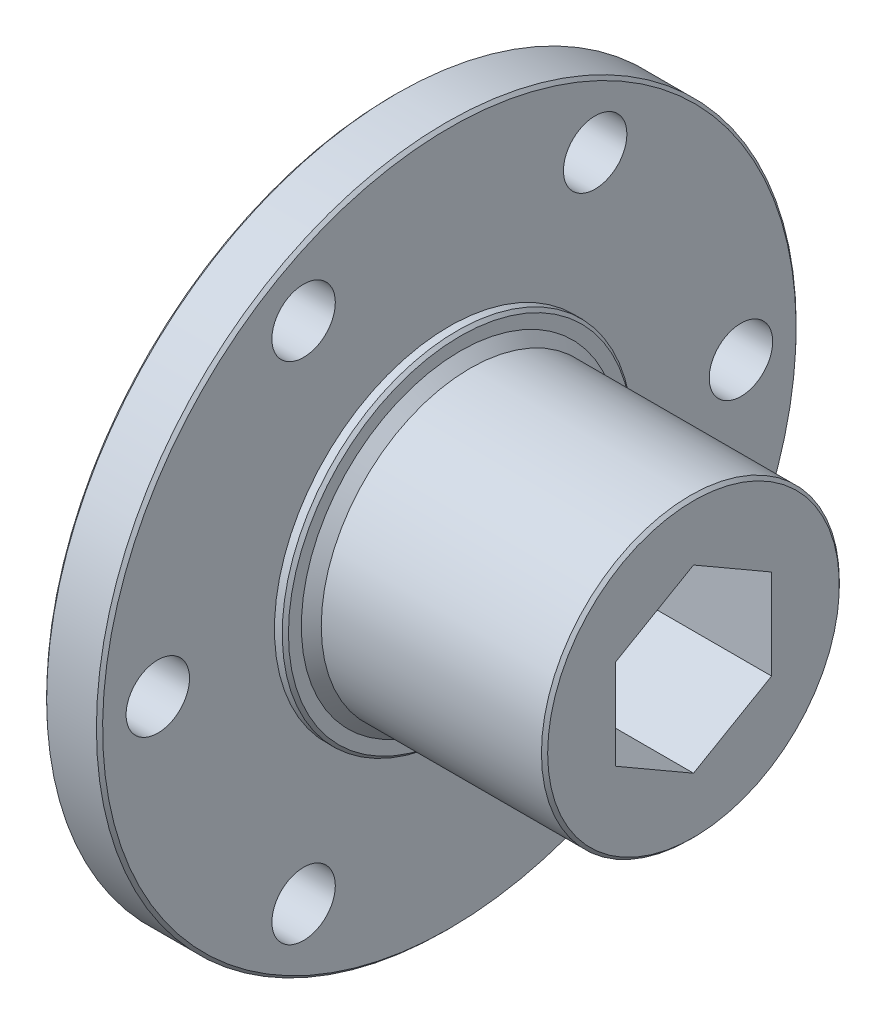
ISO-10303-21;
HEADER;
FILE_DESCRIPTION(('STEP AP214'),'2;1');
FILE_NAME('part.step','',(''),(''),'','','');
FILE_SCHEMA(('AUTOMOTIVE_DESIGN { 1 0 10303 214 1 1 1 1 }'));
ENDSEC;
DATA;
#1=APPLICATION_CONTEXT('core data for automotive mechanical design processes');
#2=APPLICATION_PROTOCOL_DEFINITION('international standard','automotive_design',2000,#1);
#3=PRODUCT_CONTEXT('',#1,'mechanical');
#4=PRODUCT('Part','Part','',(#3));
#5=PRODUCT_RELATED_PRODUCT_CATEGORY('part','',(#4));
#6=PRODUCT_DEFINITION_FORMATION('','',#4);
#7=PRODUCT_DEFINITION_CONTEXT('part definition',#1,'design');
#8=PRODUCT_DEFINITION('design','',#6,#7);
#9=PRODUCT_DEFINITION_SHAPE('','',#8);
#10=(LENGTH_UNIT() NAMED_UNIT(*) SI_UNIT(.MILLI.,.METRE.));
#11=(NAMED_UNIT(*) PLANE_ANGLE_UNIT() SI_UNIT($,.RADIAN.));
#12=(NAMED_UNIT(*) SI_UNIT($,.STERADIAN.) SOLID_ANGLE_UNIT());
#13=UNCERTAINTY_MEASURE_WITH_UNIT(LENGTH_MEASURE(1.E-05),#10,'distance_accuracy_value','');
#14=(GEOMETRIC_REPRESENTATION_CONTEXT(3) GLOBAL_UNCERTAINTY_ASSIGNED_CONTEXT((#13)) GLOBAL_UNIT_ASSIGNED_CONTEXT((#10,
#11,#12)) REPRESENTATION_CONTEXT('',''));
#15=CARTESIAN_POINT('',(0.,0.,0.));
#16=DIRECTION('',(0.,0.,1.));
#17=DIRECTION('',(1.,0.,0.));
#18=AXIS2_PLACEMENT_3D('',#15,#16,#17);
#19=CARTESIAN_POINT('',(6.01493375394323,0.,0.));
#20=DIRECTION('',(-1.,0.,0.));
#21=DIRECTION('',(0.,0.,1.));
#22=AXIS2_PLACEMENT_3D('',#19,#20,#21);
#23=CYLINDRICAL_SURFACE('',#22,12.1666);
#24=CARTESIAN_POINT('',(5.76093375394327,0.,0.));
#25=DIRECTION('',(-1.,0.,0.));
#26=DIRECTION('',(0.,0.,1.));
#27=AXIS2_PLACEMENT_3D('',#24,#25,#26);
#28=CIRCLE('',#27,12.1666);
#29=CARTESIAN_POINT('',(5.76093375394327,0.,12.1666));
#30=VERTEX_POINT('',#29);
#31=EDGE_CURVE('E99',#30,#30,#28,.F.);
#32=ORIENTED_EDGE('',*,*,#31,.F.);
#33=EDGE_LOOP('',(#32));
#34=FACE_BOUND('',#33,.T.);
#35=CARTESIAN_POINT('',(-12.2222662460567,0.,0.));
#36=DIRECTION('',(-1.,0.,0.));
#37=DIRECTION('',(0.,0.,1.));
#38=AXIS2_PLACEMENT_3D('',#35,#36,#37);
#39=CIRCLE('',#38,12.1666);
#40=CARTESIAN_POINT('',(-12.2222662460567,0.,12.1666));
#41=VERTEX_POINT('',#40);
#42=EDGE_CURVE('E96',#41,#41,#39,.T.);
#43=ORIENTED_EDGE('',*,*,#42,.F.);
#44=EDGE_LOOP('',(#43));
#45=FACE_BOUND('',#44,.T.);
#46=ADVANCED_FACE('F15',(#34,#45),#23,.T.);
#47=CARTESIAN_POINT('',(5.76093375394327,0.,0.));
#48=DIRECTION('',(-1.,0.,0.));
#49=DIRECTION('',(0.,0.,1.));
#50=AXIS2_PLACEMENT_3D('',#47,#48,#49);
#51=CONICAL_SURFACE('',#50,12.1666,0.785398163397465);
#52=ORIENTED_EDGE('',*,*,#31,.T.);
#53=EDGE_LOOP('',(#52));
#54=FACE_BOUND('',#53,.T.);
#55=CARTESIAN_POINT('',(6.01493375394323,0.,0.));
#56=DIRECTION('',(-1.,0.,0.));
#57=DIRECTION('',(0.,0.,1.));
#58=AXIS2_PLACEMENT_3D('',#55,#56,#57);
#59=CIRCLE('',#58,11.9126);
#60=CARTESIAN_POINT('',(6.01493375394323,0.,11.9126));
#61=VERTEX_POINT('',#60);
#62=EDGE_CURVE('E18',#61,#61,#59,.F.);
#63=ORIENTED_EDGE('',*,*,#62,.F.);
#64=EDGE_LOOP('',(#63));
#65=FACE_BOUND('',#64,.T.);
#66=ADVANCED_FACE('F162',(#54,#65),#51,.T.);
#67=CARTESIAN_POINT('',(-13.0350662460568,0.,0.));
#68=DIRECTION('',(-1.,0.,0.));
#69=DIRECTION('',(0.,-1.,0.));
#70=AXIS2_PLACEMENT_3D('',#67,#68,#69);
#71=CONICAL_SURFACE('',#70,12.9794,0.785398163397438);
#72=ORIENTED_EDGE('',*,*,#42,.T.);
#73=EDGE_LOOP('',(#72));
#74=FACE_BOUND('',#73,.T.);
#75=CARTESIAN_POINT('',(-13.0350662460568,0.,0.));
#76=DIRECTION('',(-1.,0.,0.));
#77=DIRECTION('',(0.,-1.,0.));
#78=AXIS2_PLACEMENT_3D('',#75,#76,#77);
#79=CIRCLE('',#78,12.9794);
#80=CARTESIAN_POINT('',(-13.0350662460568,-12.9794,0.));
#81=VERTEX_POINT('',#80);
#82=EDGE_CURVE('E81',#81,#81,#79,.T.);
#83=ORIENTED_EDGE('',*,*,#82,.F.);
#84=EDGE_LOOP('',(#83));
#85=FACE_BOUND('',#84,.T.);
#86=ADVANCED_FACE('F164',(#74,#85),#71,.T.);
#87=CARTESIAN_POINT('',(6.01493375394323,0.,0.));
#88=DIRECTION('',(1.,0.,0.));
#89=DIRECTION('',(0.,0.,-1.));
#90=AXIS2_PLACEMENT_3D('',#87,#88,#89);
#91=PLANE('',#90);
#92=DIRECTION('',(0.,1.,0.));
#93=VECTOR('',#92,1.);
#94=CARTESIAN_POINT('',(6.01493375394323,-3.68085890619153,-6.37539999999999));
#95=LINE('',#94,#93);
#96=CARTESIAN_POINT('',(6.01493375394323,3.68081890619155,-6.37539999999999));
#97=VERTEX_POINT('',#96);
#98=CARTESIAN_POINT('',(6.01493375394323,-3.68085890619153,-6.37539999999999));
#99=VERTEX_POINT('',#98);
#100=EDGE_CURVE('E90',#97,#99,#95,.F.);
#101=ORIENTED_EDGE('',*,*,#100,.T.);
#102=DIRECTION('',(0.,0.500000000000001,-0.866025403784438));
#103=VECTOR('',#102,1.);
#104=CARTESIAN_POINT('',(6.01493375394323,-7.36169781238308,0.));
#105=LINE('',#104,#103);
#106=CARTESIAN_POINT('',(6.01493375394323,-7.36169781238308,0.));
#107=VERTEX_POINT('',#106);
#108=EDGE_CURVE('E66',#99,#107,#105,.F.);
#109=ORIENTED_EDGE('',*,*,#108,.T.);
#110=DIRECTION('',(0.,-0.500000000000001,-0.866025403784438));
#111=VECTOR('',#110,1.);
#112=CARTESIAN_POINT('',(6.01493375394323,-3.68085890619153,6.3754));
#113=LINE('',#112,#111);
#114=CARTESIAN_POINT('',(6.01493375394323,-3.68085890619153,6.3754));
#115=VERTEX_POINT('',#114);
#116=EDGE_CURVE('E72',#107,#115,#113,.F.);
#117=ORIENTED_EDGE('',*,*,#116,.T.);
#118=DIRECTION('',(0.,-1.,0.));
#119=VECTOR('',#118,1.);
#120=CARTESIAN_POINT('',(6.01493375394323,3.68081890619155,6.3754));
#121=LINE('',#120,#119);
#122=CARTESIAN_POINT('',(6.01493375394323,3.68081890619155,6.3754));
#123=VERTEX_POINT('',#122);
#124=EDGE_CURVE('E155',#115,#123,#121,.F.);
#125=ORIENTED_EDGE('',*,*,#124,.T.);
#126=DIRECTION('',(0.,-0.500000000000001,0.866025403784438));
#127=VECTOR('',#126,1.);
#128=CARTESIAN_POINT('',(6.01493375394323,7.3616578123831,0.));
#129=LINE('',#128,#127);
#130=CARTESIAN_POINT('',(6.01493375394323,7.3616578123831,0.));
#131=VERTEX_POINT('',#130);
#132=EDGE_CURVE('E480',#123,#131,#129,.F.);
#133=ORIENTED_EDGE('',*,*,#132,.T.);
#134=DIRECTION('',(0.,0.500000000000001,0.866025403784438));
#135=VECTOR('',#134,1.);
#136=CARTESIAN_POINT('',(6.01493375394323,3.68081890619155,-6.37539999999999));
#137=LINE('',#136,#135);
#138=EDGE_CURVE('E486',#131,#97,#137,.F.);
#139=ORIENTED_EDGE('',*,*,#138,.T.);
#140=EDGE_LOOP('',(#101,#109,#117,#125,#133,#139));
#141=FACE_BOUND('',#140,.T.);
#142=ORIENTED_EDGE('',*,*,#62,.T.);
#143=EDGE_LOOP('',(#142));
#144=FACE_BOUND('',#143,.T.);
#145=ADVANCED_FACE('F87',(#141,#144),#91,.T.);
#146=CARTESIAN_POINT('',(-13.0350662460568,28.575,0.));
#147=DIRECTION('',(1.,0.,0.));
#148=DIRECTION('',(0.,0.,-1.));
#149=AXIS2_PLACEMENT_3D('',#146,#147,#148);
#150=PLANE('',#149);
#151=ORIENTED_EDGE('',*,*,#82,.T.);
#152=EDGE_LOOP('',(#151));
#153=FACE_BOUND('',#152,.T.);
#154=CARTESIAN_POINT('',(-13.0350662460568,0.,0.));
#155=DIRECTION('',(-1.,0.,0.));
#156=DIRECTION('',(0.,-1.,0.));
#157=AXIS2_PLACEMENT_3D('',#154,#155,#156);
#158=CIRCLE('',#157,14.0335);
#159=CARTESIAN_POINT('',(-13.0350662460568,-14.0335,0.));
#160=VERTEX_POINT('',#159);
#161=EDGE_CURVE('E152',#160,#160,#158,.T.);
#162=ORIENTED_EDGE('',*,*,#161,.F.);
#163=EDGE_LOOP('',(#162));
#164=FACE_BOUND('',#163,.T.);
#165=ADVANCED_FACE('F262',(#153,#164),#150,.T.);
#166=CARTESIAN_POINT('',(-19.3850662460568,-3.68085890619153,6.3754));
#167=DIRECTION('',(0.,-0.866025403784438,0.500000000000001));
#168=DIRECTION('',(0.,-0.500000000000001,-0.866025403784438));
#169=AXIS2_PLACEMENT_3D('',#166,#167,#168);
#170=PLANE('',#169);
#171=DIRECTION('',(1.,0.,0.));
#172=VECTOR('',#171,1.);
#173=CARTESIAN_POINT('',(-19.3850662460568,-7.36169781238308,0.));
#174=LINE('',#173,#172);
#175=CARTESIAN_POINT('',(-19.3850662460568,-7.36169781238308,0.));
#176=VERTEX_POINT('',#175);
#177=EDGE_CURVE('E75',#107,#176,#174,.F.);
#178=ORIENTED_EDGE('',*,*,#177,.T.);
#179=DIRECTION('',(0.,-0.500000000000001,-0.866025403784438));
#180=VECTOR('',#179,1.);
#181=CARTESIAN_POINT('',(-19.3850662460568,-3.68085890619153,6.3754));
#182=LINE('',#181,#180);
#183=CARTESIAN_POINT('',(-19.3850662460568,-3.68085890619153,6.3754));
#184=VERTEX_POINT('',#183);
#185=EDGE_CURVE('E154',#184,#176,#182,.T.);
#186=ORIENTED_EDGE('',*,*,#185,.F.);
#187=DIRECTION('',(1.,0.,0.));
#188=VECTOR('',#187,1.);
#189=CARTESIAN_POINT('',(-19.3850662460568,-3.68085890619153,6.3754));
#190=LINE('',#189,#188);
#191=EDGE_CURVE('E77',#184,#115,#190,.T.);
#192=ORIENTED_EDGE('',*,*,#191,.T.);
#193=ORIENTED_EDGE('',*,*,#116,.F.);
#194=EDGE_LOOP('',(#178,#186,#192,#193));
#195=FACE_BOUND('',#194,.T.);
#196=ADVANCED_FACE('F73',(#195),#170,.F.);
#197=CARTESIAN_POINT('',(-19.3850662460568,-7.36169781238308,0.));
#198=DIRECTION('',(0.,-0.866025403784438,-0.500000000000001));
#199=DIRECTION('',(0.,0.500000000000001,-0.866025403784438));
#200=AXIS2_PLACEMENT_3D('',#197,#198,#199);
#201=PLANE('',#200);
#202=DIRECTION('',(1.,0.,0.));
#203=VECTOR('',#202,1.);
#204=CARTESIAN_POINT('',(-19.3850662460568,-3.68085890619153,-6.37539999999999));
#205=LINE('',#204,#203);
#206=CARTESIAN_POINT('',(-19.3850662460568,-3.68085890619153,-6.37539999999999));
#207=VERTEX_POINT('',#206);
#208=EDGE_CURVE('E91',#99,#207,#205,.F.);
#209=ORIENTED_EDGE('',*,*,#208,.T.);
#210=DIRECTION('',(0.,0.500000000000001,-0.866025403784438));
#211=VECTOR('',#210,1.);
#212=CARTESIAN_POINT('',(-19.3850662460568,-7.36169781238308,0.));
#213=LINE('',#212,#211);
#214=EDGE_CURVE('E84',#176,#207,#213,.T.);
#215=ORIENTED_EDGE('',*,*,#214,.F.);
#216=ORIENTED_EDGE('',*,*,#177,.F.);
#217=ORIENTED_EDGE('',*,*,#108,.F.);
#218=EDGE_LOOP('',(#209,#215,#216,#217));
#219=FACE_BOUND('',#218,.T.);
#220=ADVANCED_FACE('F83',(#219),#201,.F.);
#221=CARTESIAN_POINT('',(-19.3850662460568,-3.68085890619153,-6.37539999999999));
#222=DIRECTION('',(0.,0.,-1.));
#223=DIRECTION('',(0.,1.,0.));
#224=AXIS2_PLACEMENT_3D('',#221,#222,#223);
#225=PLANE('',#224);
#226=DIRECTION('',(1.,0.,0.));
#227=VECTOR('',#226,1.);
#228=CARTESIAN_POINT('',(-19.3850662460568,3.68081890619155,-6.37539999999999));
#229=LINE('',#228,#227);
#230=CARTESIAN_POINT('',(-19.3850662460568,3.68081890619155,-6.37539999999999));
#231=VERTEX_POINT('',#230);
#232=EDGE_CURVE('E488',#97,#231,#229,.F.);
#233=ORIENTED_EDGE('',*,*,#232,.T.);
#234=DIRECTION('',(0.,1.,0.));
#235=VECTOR('',#234,1.);
#236=CARTESIAN_POINT('',(-19.3850662460568,0.,-6.37539999999999));
#237=LINE('',#236,#235);
#238=EDGE_CURVE('E493',#207,#231,#237,.T.);
#239=ORIENTED_EDGE('',*,*,#238,.F.);
#240=ORIENTED_EDGE('',*,*,#208,.F.);
#241=ORIENTED_EDGE('',*,*,#100,.F.);
#242=EDGE_LOOP('',(#233,#239,#240,#241));
#243=FACE_BOUND('',#242,.T.);
#244=ADVANCED_FACE('F253',(#243),#225,.F.);
#245=CARTESIAN_POINT('',(-19.3850662460568,3.68081890619155,-6.37539999999999));
#246=DIRECTION('',(0.,0.866025403784438,-0.500000000000001));
#247=DIRECTION('',(0.,0.500000000000001,0.866025403784438));
#248=AXIS2_PLACEMENT_3D('',#245,#246,#247);
#249=PLANE('',#248);
#250=DIRECTION('',(1.,0.,0.));
#251=VECTOR('',#250,1.);
#252=CARTESIAN_POINT('',(-19.3850662460568,7.3616578123831,0.));
#253=LINE('',#252,#251);
#254=CARTESIAN_POINT('',(-19.3850662460568,7.3616578123831,0.));
#255=VERTEX_POINT('',#254);
#256=EDGE_CURVE('E483',#131,#255,#253,.F.);
#257=ORIENTED_EDGE('',*,*,#256,.T.);
#258=DIRECTION('',(0.,0.500000000000001,0.866025403784438));
#259=VECTOR('',#258,1.);
#260=CARTESIAN_POINT('',(-19.3850662460568,3.68081890619155,-6.37539999999999));
#261=LINE('',#260,#259);
#262=EDGE_CURVE('E494',#231,#255,#261,.T.);
#263=ORIENTED_EDGE('',*,*,#262,.F.);
#264=ORIENTED_EDGE('',*,*,#232,.F.);
#265=ORIENTED_EDGE('',*,*,#138,.F.);
#266=EDGE_LOOP('',(#257,#263,#264,#265));
#267=FACE_BOUND('',#266,.T.);
#268=ADVANCED_FACE('F249',(#267),#249,.F.);
#269=CARTESIAN_POINT('',(-19.3850662460568,7.3616578123831,0.));
#270=DIRECTION('',(0.,0.866025403784438,0.500000000000001));
#271=DIRECTION('',(0.,-0.500000000000001,0.866025403784438));
#272=AXIS2_PLACEMENT_3D('',#269,#270,#271);
#273=PLANE('',#272);
#274=DIRECTION('',(1.,0.,0.));
#275=VECTOR('',#274,1.);
#276=CARTESIAN_POINT('',(-19.3850662460568,3.68081890619155,6.3754));
#277=LINE('',#276,#275);
#278=CARTESIAN_POINT('',(-19.3850662460568,3.68081890619155,6.3754));
#279=VERTEX_POINT('',#278);
#280=EDGE_CURVE('E478',#123,#279,#277,.F.);
#281=ORIENTED_EDGE('',*,*,#280,.T.);
#282=DIRECTION('',(0.,-0.500000000000001,0.866025403784438));
#283=VECTOR('',#282,1.);
#284=CARTESIAN_POINT('',(-19.3850662460568,7.3616578123831,0.));
#285=LINE('',#284,#283);
#286=EDGE_CURVE('E33',#255,#279,#285,.T.);
#287=ORIENTED_EDGE('',*,*,#286,.F.);
#288=ORIENTED_EDGE('',*,*,#256,.F.);
#289=ORIENTED_EDGE('',*,*,#132,.F.);
#290=EDGE_LOOP('',(#281,#287,#288,#289));
#291=FACE_BOUND('',#290,.T.);
#292=ADVANCED_FACE('F245',(#291),#273,.F.);
#293=CARTESIAN_POINT('',(-19.3850662460568,3.68081890619155,6.3754));
#294=DIRECTION('',(0.,0.,1.));
#295=DIRECTION('',(0.,-1.,0.));
#296=AXIS2_PLACEMENT_3D('',#293,#294,#295);
#297=PLANE('',#296);
#298=ORIENTED_EDGE('',*,*,#191,.F.);
#299=DIRECTION('',(0.,1.,0.));
#300=VECTOR('',#299,1.);
#301=CARTESIAN_POINT('',(-19.3850662460568,0.,6.3754));
#302=LINE('',#301,#300);
#303=EDGE_CURVE('E469',#279,#184,#302,.F.);
#304=ORIENTED_EDGE('',*,*,#303,.F.);
#305=ORIENTED_EDGE('',*,*,#280,.F.);
#306=ORIENTED_EDGE('',*,*,#124,.F.);
#307=EDGE_LOOP('',(#298,#304,#305,#306));
#308=FACE_BOUND('',#307,.T.);
#309=ADVANCED_FACE('F241',(#308),#297,.F.);
#310=CARTESIAN_POINT('',(-13.2890662460568,0.,0.));
#311=DIRECTION('',(-1.,0.,0.));
#312=DIRECTION('',(0.,-1.,0.));
#313=AXIS2_PLACEMENT_3D('',#310,#311,#312);
#314=CONICAL_SURFACE('',#313,14.2875,0.785398163397452);
#315=ORIENTED_EDGE('',*,*,#161,.T.);
#316=EDGE_LOOP('',(#315));
#317=FACE_BOUND('',#316,.T.);
#318=CARTESIAN_POINT('',(-13.2890662460568,0.,0.));
#319=DIRECTION('',(1.,0.,0.));
#320=DIRECTION('',(0.,0.,-1.));
#321=AXIS2_PLACEMENT_3D('',#318,#319,#320);
#322=CIRCLE('',#321,14.2875);
#323=CARTESIAN_POINT('',(-13.2890662460568,0.,-14.2875));
#324=VERTEX_POINT('',#323);
#325=EDGE_CURVE('E467',#324,#324,#322,.F.);
#326=ORIENTED_EDGE('',*,*,#325,.F.);
#327=EDGE_LOOP('',(#326));
#328=FACE_BOUND('',#327,.T.);
#329=ADVANCED_FACE('F238',(#317,#328),#314,.T.);
#330=CARTESIAN_POINT('',(-19.3850662460568,0.,0.));
#331=DIRECTION('',(-1.,0.,0.));
#332=DIRECTION('',(0.,0.,1.));
#333=AXIS2_PLACEMENT_3D('',#330,#331,#332);
#334=PLANE('',#333);
#335=ORIENTED_EDGE('',*,*,#286,.T.);
#336=ORIENTED_EDGE('',*,*,#303,.T.);
#337=ORIENTED_EDGE('',*,*,#185,.T.);
#338=ORIENTED_EDGE('',*,*,#214,.T.);
#339=ORIENTED_EDGE('',*,*,#238,.T.);
#340=ORIENTED_EDGE('',*,*,#262,.T.);
#341=EDGE_LOOP('',(#335,#336,#337,#338,#339,#340));
#342=FACE_BOUND('',#341,.T.);
#343=CARTESIAN_POINT('',(-19.3850662460568,0.,0.));
#344=DIRECTION('',(1.,0.,0.));
#345=DIRECTION('',(0.,0.,-1.));
#346=AXIS2_PLACEMENT_3D('',#343,#344,#345);
#347=CIRCLE('',#346,14.0335);
#348=CARTESIAN_POINT('',(-19.3850662460568,0.,-14.0335));
#349=VERTEX_POINT('',#348);
#350=EDGE_CURVE('E148',#349,#349,#347,.T.);
#351=ORIENTED_EDGE('',*,*,#350,.F.);
#352=EDGE_LOOP('',(#351));
#353=FACE_BOUND('',#352,.T.);
#354=ADVANCED_FACE('F234',(#342,#353),#334,.T.);
#355=CARTESIAN_POINT('',(-14.1780662460568,0.,0.));
#356=DIRECTION('',(-1.,0.,0.));
#357=DIRECTION('',(0.,-1.,0.));
#358=AXIS2_PLACEMENT_3D('',#355,#356,#357);
#359=CONICAL_SURFACE('',#358,28.575,0.785398163397445);
#360=CARTESIAN_POINT('',(-14.1780662460568,0.,0.));
#361=DIRECTION('',(-1.,0.,0.));
#362=DIRECTION('',(0.,0.,1.));
#363=AXIS2_PLACEMENT_3D('',#360,#361,#362);
#364=CIRCLE('',#363,28.575);
#365=CARTESIAN_POINT('',(-14.1780662460568,0.,28.575));
#366=VERTEX_POINT('',#365);
#367=EDGE_CURVE('E151',#366,#366,#364,.T.);
#368=ORIENTED_EDGE('',*,*,#367,.F.);
#369=EDGE_LOOP('',(#368));
#370=FACE_BOUND('',#369,.T.);
#371=CARTESIAN_POINT('',(-13.9240662460568,0.,0.));
#372=DIRECTION('',(-1.,0.,0.));
#373=DIRECTION('',(0.,-1.,0.));
#374=AXIS2_PLACEMENT_3D('',#371,#372,#373);
#375=CIRCLE('',#374,28.321);
#376=CARTESIAN_POINT('',(-13.9240662460568,-28.321,0.));
#377=VERTEX_POINT('',#376);
#378=EDGE_CURVE('E145',#377,#377,#375,.F.);
#379=ORIENTED_EDGE('',*,*,#378,.F.);
#380=EDGE_LOOP('',(#379));
#381=FACE_BOUND('',#380,.T.);
#382=ADVANCED_FACE('F230',(#370,#381),#359,.T.);
#383=CARTESIAN_POINT('',(14.3030238953624,0.,0.));
#384=DIRECTION('',(1.,0.,0.));
#385=DIRECTION('',(0.,0.,-1.));
#386=AXIS2_PLACEMENT_3D('',#383,#384,#385);
#387=CYLINDRICAL_SURFACE('',#386,14.2875);
#388=CARTESIAN_POINT('',(-13.9240662460568,0.,0.));
#389=DIRECTION('',(1.,0.,0.));
#390=DIRECTION('',(0.,0.,-1.));
#391=AXIS2_PLACEMENT_3D('',#388,#389,#390);
#392=CIRCLE('',#391,14.2875);
#393=CARTESIAN_POINT('',(-13.9240662460568,0.,-14.2875));
#394=VERTEX_POINT('',#393);
#395=EDGE_CURVE('E142',#394,#394,#392,.F.);
#396=ORIENTED_EDGE('',*,*,#395,.F.);
#397=EDGE_LOOP('',(#396));
#398=FACE_BOUND('',#397,.T.);
#399=ORIENTED_EDGE('',*,*,#325,.T.);
#400=EDGE_LOOP('',(#399));
#401=FACE_BOUND('',#400,.T.);
#402=ADVANCED_FACE('F226',(#398,#401),#387,.T.);
#403=CARTESIAN_POINT('',(-13.0350662460568,0.,0.));
#404=DIRECTION('',(-1.,0.,0.));
#405=DIRECTION('',(0.,0.,1.));
#406=AXIS2_PLACEMENT_3D('',#403,#404,#405);
#407=CYLINDRICAL_SURFACE('',#406,28.575);
#408=ORIENTED_EDGE('',*,*,#367,.T.);
#409=EDGE_LOOP('',(#408));
#410=FACE_BOUND('',#409,.T.);
#411=CARTESIAN_POINT('',(-18.2420662460568,0.,0.));
#412=DIRECTION('',(1.,0.,0.));
#413=DIRECTION('',(0.,0.,-1.));
#414=AXIS2_PLACEMENT_3D('',#411,#412,#413);
#415=CIRCLE('',#414,28.575);
#416=CARTESIAN_POINT('',(-18.2420662460568,0.,-28.575));
#417=VERTEX_POINT('',#416);
#418=EDGE_CURVE('E141',#417,#417,#415,.F.);
#419=ORIENTED_EDGE('',*,*,#418,.F.);
#420=EDGE_LOOP('',(#419));
#421=FACE_BOUND('',#420,.T.);
#422=ADVANCED_FACE('F222',(#410,#421),#407,.T.);
#423=CARTESIAN_POINT('',(-19.1310662460568,0.,0.));
#424=DIRECTION('',(1.,0.,0.));
#425=DIRECTION('',(0.,0.,-1.));
#426=AXIS2_PLACEMENT_3D('',#423,#424,#425);
#427=CONICAL_SURFACE('',#426,14.2875,0.785398163397452);
#428=CARTESIAN_POINT('',(-19.1310662460568,0.,0.));
#429=DIRECTION('',(1.,0.,0.));
#430=DIRECTION('',(0.,0.,-1.));
#431=AXIS2_PLACEMENT_3D('',#428,#429,#430);
#432=CIRCLE('',#431,14.2875);
#433=CARTESIAN_POINT('',(-19.1310662460568,0.,-14.2875));
#434=VERTEX_POINT('',#433);
#435=EDGE_CURVE('E131',#434,#434,#432,.T.);
#436=ORIENTED_EDGE('',*,*,#435,.F.);
#437=EDGE_LOOP('',(#436));
#438=FACE_BOUND('',#437,.T.);
#439=ORIENTED_EDGE('',*,*,#350,.T.);
#440=EDGE_LOOP('',(#439));
#441=FACE_BOUND('',#440,.T.);
#442=ADVANCED_FACE('F218',(#438,#441),#427,.T.);
#443=CARTESIAN_POINT('',(-13.9240662460568,0.,5.72637987752451));
#444=DIRECTION('',(1.,0.,0.));
#445=DIRECTION('',(0.,0.,-1.));
#446=AXIS2_PLACEMENT_3D('',#443,#444,#445);
#447=PLANE('',#446);
#448=CARTESIAN_POINT('',(-13.9240662460568,0.,23.8125));
#449=DIRECTION('',(1.,0.,0.));
#450=DIRECTION('',(0.,0.,-1.));
#451=AXIS2_PLACEMENT_3D('',#448,#449,#450);
#452=CIRCLE('',#451,2.59080000000001);
#453=CARTESIAN_POINT('',(-13.9240662460568,0.,21.2217));
#454=VERTEX_POINT('',#453);
#455=EDGE_CURVE('E122',#454,#454,#452,.F.);
#456=ORIENTED_EDGE('',*,*,#455,.T.);
#457=EDGE_LOOP('',(#456));
#458=FACE_BOUND('',#457,.T.);
#459=CARTESIAN_POINT('',(-13.9240662460568,20.622229927617,-11.90625));
#460=DIRECTION('',(1.,0.,0.));
#461=DIRECTION('',(0.,0.,-1.));
#462=AXIS2_PLACEMENT_3D('',#459,#460,#461);
#463=CIRCLE('',#462,2.59080000000001);
#464=CARTESIAN_POINT('',(-13.9240662460568,20.622229927617,-14.49705));
#465=VERTEX_POINT('',#464);
#466=EDGE_CURVE('E125',#465,#465,#463,.F.);
#467=ORIENTED_EDGE('',*,*,#466,.T.);
#468=EDGE_LOOP('',(#467));
#469=FACE_BOUND('',#468,.T.);
#470=CARTESIAN_POINT('',(-13.9240662460568,-20.6222299276169,-11.90625));
#471=DIRECTION('',(1.,0.,0.));
#472=DIRECTION('',(0.,0.,-1.));
#473=AXIS2_PLACEMENT_3D('',#470,#471,#472);
#474=CIRCLE('',#473,2.59080000000001);
#475=CARTESIAN_POINT('',(-13.9240662460568,-20.6222299276169,-14.4970500000001));
#476=VERTEX_POINT('',#475);
#477=EDGE_CURVE('E128',#476,#476,#474,.F.);
#478=ORIENTED_EDGE('',*,*,#477,.T.);
#479=EDGE_LOOP('',(#478));
#480=FACE_BOUND('',#479,.T.);
#481=ORIENTED_EDGE('',*,*,#395,.T.);
#482=EDGE_LOOP('',(#481));
#483=FACE_BOUND('',#482,.T.);
#484=CARTESIAN_POINT('',(-13.9240662460568,-20.622229927617,11.9062499999999));
#485=DIRECTION('',(1.,0.,0.));
#486=DIRECTION('',(0.,0.,-1.));
#487=AXIS2_PLACEMENT_3D('',#484,#485,#486);
#488=CIRCLE('',#487,2.59080000000001);
#489=CARTESIAN_POINT('',(-13.9240662460568,-20.622229927617,9.31544999999993));
#490=VERTEX_POINT('',#489);
#491=EDGE_CURVE('E132',#490,#490,#488,.F.);
#492=ORIENTED_EDGE('',*,*,#491,.T.);
#493=EDGE_LOOP('',(#492));
#494=FACE_BOUND('',#493,.T.);
#495=CARTESIAN_POINT('',(-13.9240662460568,0.,-23.8125));
#496=DIRECTION('',(1.,0.,0.));
#497=DIRECTION('',(0.,0.,-1.));
#498=AXIS2_PLACEMENT_3D('',#495,#496,#497);
#499=CIRCLE('',#498,2.59080000000001);
#500=CARTESIAN_POINT('',(-13.9240662460568,0.,-26.4033));
#501=VERTEX_POINT('',#500);
#502=EDGE_CURVE('E135',#501,#501,#499,.F.);
#503=ORIENTED_EDGE('',*,*,#502,.T.);
#504=EDGE_LOOP('',(#503));
#505=FACE_BOUND('',#504,.T.);
#506=CARTESIAN_POINT('',(-13.9240662460568,20.6222299276169,11.90625));
#507=DIRECTION('',(1.,0.,0.));
#508=DIRECTION('',(0.,0.,-1.));
#509=AXIS2_PLACEMENT_3D('',#506,#507,#508);
#510=CIRCLE('',#509,2.59080000000001);
#511=CARTESIAN_POINT('',(-13.9240662460568,20.6222299276169,9.31544999999999));
#512=VERTEX_POINT('',#511);
#513=EDGE_CURVE('E138',#512,#512,#510,.F.);
#514=ORIENTED_EDGE('',*,*,#513,.T.);
#515=EDGE_LOOP('',(#514));
#516=FACE_BOUND('',#515,.T.);
#517=ORIENTED_EDGE('',*,*,#378,.T.);
#518=EDGE_LOOP('',(#517));
#519=FACE_BOUND('',#518,.T.);
#520=ADVANCED_FACE('F214',(#458,#469,#480,#483,#494,#505,#516,#519),#447,.T.);
#521=CARTESIAN_POINT('',(-18.2420662460568,0.,0.));
#522=DIRECTION('',(1.,0.,0.));
#523=DIRECTION('',(0.,0.,-1.));
#524=AXIS2_PLACEMENT_3D('',#521,#522,#523);
#525=CONICAL_SURFACE('',#524,28.575,0.785398163397448);
#526=CARTESIAN_POINT('',(-18.4960662460568,0.,0.));
#527=DIRECTION('',(1.,0.,0.));
#528=DIRECTION('',(0.,0.,-1.));
#529=AXIS2_PLACEMENT_3D('',#526,#527,#528);
#530=CIRCLE('',#529,28.321);
#531=CARTESIAN_POINT('',(-18.4960662460568,0.,-28.321));
#532=VERTEX_POINT('',#531);
#533=EDGE_CURVE('E119',#532,#532,#530,.T.);
#534=ORIENTED_EDGE('',*,*,#533,.T.);
#535=EDGE_LOOP('',(#534));
#536=FACE_BOUND('',#535,.T.);
#537=ORIENTED_EDGE('',*,*,#418,.T.);
#538=EDGE_LOOP('',(#537));
#539=FACE_BOUND('',#538,.T.);
#540=ADVANCED_FACE('F210',(#536,#539),#525,.T.);
#541=CARTESIAN_POINT('',(-13.0350662460568,20.6222299276169,11.90625));
#542=DIRECTION('',(1.,0.,0.));
#543=DIRECTION('',(0.,0.,-1.));
#544=AXIS2_PLACEMENT_3D('',#541,#542,#543);
#545=CYLINDRICAL_SURFACE('',#544,2.59080000000001);
#546=ORIENTED_EDGE('',*,*,#513,.F.);
#547=EDGE_LOOP('',(#546));
#548=FACE_BOUND('',#547,.T.);
#549=CARTESIAN_POINT('',(-18.4960662460568,20.6222299276169,11.90625));
#550=DIRECTION('',(1.,0.,0.));
#551=DIRECTION('',(0.,0.,-1.));
#552=AXIS2_PLACEMENT_3D('',#549,#550,#551);
#553=CIRCLE('',#552,2.59080000000001);
#554=CARTESIAN_POINT('',(-18.4960662460568,20.6222299276169,9.31544999999999));
#555=VERTEX_POINT('',#554);
#556=EDGE_CURVE('E116',#555,#555,#553,.F.);
#557=ORIENTED_EDGE('',*,*,#556,.T.);
#558=EDGE_LOOP('',(#557));
#559=FACE_BOUND('',#558,.T.);
#560=ADVANCED_FACE('F206',(#548,#559),#545,.F.);
#561=CARTESIAN_POINT('',(-13.0350662460568,0.,-23.8125));
#562=DIRECTION('',(1.,0.,0.));
#563=DIRECTION('',(0.,0.,-1.));
#564=AXIS2_PLACEMENT_3D('',#561,#562,#563);
#565=CYLINDRICAL_SURFACE('',#564,2.59080000000001);
#566=ORIENTED_EDGE('',*,*,#502,.F.);
#567=EDGE_LOOP('',(#566));
#568=FACE_BOUND('',#567,.T.);
#569=CARTESIAN_POINT('',(-18.4960662460568,0.,-23.8125));
#570=DIRECTION('',(1.,0.,0.));
#571=DIRECTION('',(0.,0.,-1.));
#572=AXIS2_PLACEMENT_3D('',#569,#570,#571);
#573=CIRCLE('',#572,2.59080000000001);
#574=CARTESIAN_POINT('',(-18.4960662460568,0.,-26.4033));
#575=VERTEX_POINT('',#574);
#576=EDGE_CURVE('E113',#575,#575,#573,.F.);
#577=ORIENTED_EDGE('',*,*,#576,.T.);
#578=EDGE_LOOP('',(#577));
#579=FACE_BOUND('',#578,.T.);
#580=ADVANCED_FACE('F202',(#568,#579),#565,.F.);
#581=CARTESIAN_POINT('',(-13.0350662460568,-20.622229927617,11.9062499999999));
#582=DIRECTION('',(1.,0.,0.));
#583=DIRECTION('',(0.,0.,-1.));
#584=AXIS2_PLACEMENT_3D('',#581,#582,#583);
#585=CYLINDRICAL_SURFACE('',#584,2.59080000000001);
#586=ORIENTED_EDGE('',*,*,#491,.F.);
#587=EDGE_LOOP('',(#586));
#588=FACE_BOUND('',#587,.T.);
#589=CARTESIAN_POINT('',(-18.4960662460568,-20.622229927617,11.9062499999999));
#590=DIRECTION('',(1.,0.,0.));
#591=DIRECTION('',(0.,0.,-1.));
#592=AXIS2_PLACEMENT_3D('',#589,#590,#591);
#593=CIRCLE('',#592,2.59080000000001);
#594=CARTESIAN_POINT('',(-18.4960662460568,-20.622229927617,9.31544999999993));
#595=VERTEX_POINT('',#594);
#596=EDGE_CURVE('E110',#595,#595,#593,.F.);
#597=ORIENTED_EDGE('',*,*,#596,.T.);
#598=EDGE_LOOP('',(#597));
#599=FACE_BOUND('',#598,.T.);
#600=ADVANCED_FACE('F198',(#588,#599),#585,.F.);
#601=CARTESIAN_POINT('',(14.3030238953624,0.,0.));
#602=DIRECTION('',(1.,0.,0.));
#603=DIRECTION('',(0.,0.,-1.));
#604=AXIS2_PLACEMENT_3D('',#601,#602,#603);
#605=CYLINDRICAL_SURFACE('',#604,14.2875);
#606=CARTESIAN_POINT('',(-18.4960662460568,0.,0.));
#607=DIRECTION('',(1.,0.,0.));
#608=DIRECTION('',(0.,0.,-1.));
#609=AXIS2_PLACEMENT_3D('',#606,#607,#608);
#610=CIRCLE('',#609,14.2875);
#611=CARTESIAN_POINT('',(-18.4960662460568,0.,-14.2875));
#612=VERTEX_POINT('',#611);
#613=EDGE_CURVE('E107',#612,#612,#610,.F.);
#614=ORIENTED_EDGE('',*,*,#613,.T.);
#615=EDGE_LOOP('',(#614));
#616=FACE_BOUND('',#615,.T.);
#617=ORIENTED_EDGE('',*,*,#435,.T.);
#618=EDGE_LOOP('',(#617));
#619=FACE_BOUND('',#618,.T.);
#620=ADVANCED_FACE('F194',(#616,#619),#605,.T.);
#621=CARTESIAN_POINT('',(-13.0350662460568,-20.6222299276169,-11.90625));
#622=DIRECTION('',(1.,0.,0.));
#623=DIRECTION('',(0.,0.,-1.));
#624=AXIS2_PLACEMENT_3D('',#621,#622,#623);
#625=CYLINDRICAL_SURFACE('',#624,2.59080000000001);
#626=ORIENTED_EDGE('',*,*,#477,.F.);
#627=EDGE_LOOP('',(#626));
#628=FACE_BOUND('',#627,.T.);
#629=CARTESIAN_POINT('',(-18.4960662460568,-20.6222299276169,-11.90625));
#630=DIRECTION('',(1.,0.,0.));
#631=DIRECTION('',(0.,0.,-1.));
#632=AXIS2_PLACEMENT_3D('',#629,#630,#631);
#633=CIRCLE('',#632,2.59080000000001);
#634=CARTESIAN_POINT('',(-18.4960662460568,-20.6222299276169,-14.4970500000001));
#635=VERTEX_POINT('',#634);
#636=EDGE_CURVE('E104',#635,#635,#633,.F.);
#637=ORIENTED_EDGE('',*,*,#636,.T.);
#638=EDGE_LOOP('',(#637));
#639=FACE_BOUND('',#638,.T.);
#640=ADVANCED_FACE('F190',(#628,#639),#625,.F.);
#641=CARTESIAN_POINT('',(-13.0350662460568,20.622229927617,-11.90625));
#642=DIRECTION('',(1.,0.,0.));
#643=DIRECTION('',(0.,0.,-1.));
#644=AXIS2_PLACEMENT_3D('',#641,#642,#643);
#645=CYLINDRICAL_SURFACE('',#644,2.59080000000001);
#646=ORIENTED_EDGE('',*,*,#466,.F.);
#647=EDGE_LOOP('',(#646));
#648=FACE_BOUND('',#647,.T.);
#649=CARTESIAN_POINT('',(-18.4960662460568,20.622229927617,-11.90625));
#650=DIRECTION('',(1.,0.,0.));
#651=DIRECTION('',(0.,0.,-1.));
#652=AXIS2_PLACEMENT_3D('',#649,#650,#651);
#653=CIRCLE('',#652,2.59080000000001);
#654=CARTESIAN_POINT('',(-18.4960662460568,20.622229927617,-14.49705));
#655=VERTEX_POINT('',#654);
#656=EDGE_CURVE('E24',#655,#655,#653,.F.);
#657=ORIENTED_EDGE('',*,*,#656,.T.);
#658=EDGE_LOOP('',(#657));
#659=FACE_BOUND('',#658,.T.);
#660=ADVANCED_FACE('F182',(#648,#659),#645,.F.);
#661=CARTESIAN_POINT('',(-13.0350662460568,0.,23.8125));
#662=DIRECTION('',(1.,0.,0.));
#663=DIRECTION('',(0.,0.,-1.));
#664=AXIS2_PLACEMENT_3D('',#661,#662,#663);
#665=CYLINDRICAL_SURFACE('',#664,2.59080000000001);
#666=ORIENTED_EDGE('',*,*,#455,.F.);
#667=EDGE_LOOP('',(#666));
#668=FACE_BOUND('',#667,.T.);
#669=CARTESIAN_POINT('',(-18.4960662460568,0.,23.8125));
#670=DIRECTION('',(1.,0.,0.));
#671=DIRECTION('',(0.,0.,-1.));
#672=AXIS2_PLACEMENT_3D('',#669,#670,#671);
#673=CIRCLE('',#672,2.59080000000001);
#674=CARTESIAN_POINT('',(-18.4960662460568,0.,21.2217));
#675=VERTEX_POINT('',#674);
#676=EDGE_CURVE('E10',#675,#675,#673,.F.);
#677=ORIENTED_EDGE('',*,*,#676,.T.);
#678=EDGE_LOOP('',(#677));
#679=FACE_BOUND('',#678,.T.);
#680=ADVANCED_FACE('F176',(#668,#679),#665,.F.);
#681=CARTESIAN_POINT('',(-18.4960662460568,0.,14.2875));
#682=DIRECTION('',(1.,0.,0.));
#683=DIRECTION('',(0.,0.,-1.));
#684=AXIS2_PLACEMENT_3D('',#681,#682,#683);
#685=PLANE('',#684);
#686=ORIENTED_EDGE('',*,*,#676,.F.);
#687=EDGE_LOOP('',(#686));
#688=FACE_BOUND('',#687,.T.);
#689=ORIENTED_EDGE('',*,*,#656,.F.);
#690=EDGE_LOOP('',(#689));
#691=FACE_BOUND('',#690,.T.);
#692=ORIENTED_EDGE('',*,*,#636,.F.);
#693=EDGE_LOOP('',(#692));
#694=FACE_BOUND('',#693,.T.);
#695=ORIENTED_EDGE('',*,*,#613,.F.);
#696=EDGE_LOOP('',(#695));
#697=FACE_BOUND('',#696,.T.);
#698=ORIENTED_EDGE('',*,*,#596,.F.);
#699=EDGE_LOOP('',(#698));
#700=FACE_BOUND('',#699,.T.);
#701=ORIENTED_EDGE('',*,*,#576,.F.);
#702=EDGE_LOOP('',(#701));
#703=FACE_BOUND('',#702,.T.);
#704=ORIENTED_EDGE('',*,*,#556,.F.);
#705=EDGE_LOOP('',(#704));
#706=FACE_BOUND('',#705,.T.);
#707=ORIENTED_EDGE('',*,*,#533,.F.);
#708=EDGE_LOOP('',(#707));
#709=FACE_BOUND('',#708,.T.);
#710=ADVANCED_FACE('F174',(#688,#691,#694,#697,#700,#703,#706,#709),#685,.F.);
#711=CLOSED_SHELL('',(#46,#66,#86,#145,#165,#196,#220,#244,#268,#292,#309,#329,#354,#382,#402,
#422,#442,#520,#540,#560,#580,#600,#620,#640,#660,#680,#710));
#712=MANIFOLD_SOLID_BREP('B1',#711);
#713=ADVANCED_BREP_SHAPE_REPRESENTATION('',(#18,#712),#14);
#714=SHAPE_DEFINITION_REPRESENTATION(#9,#713);
ENDSEC;
END-ISO-10303-21;
